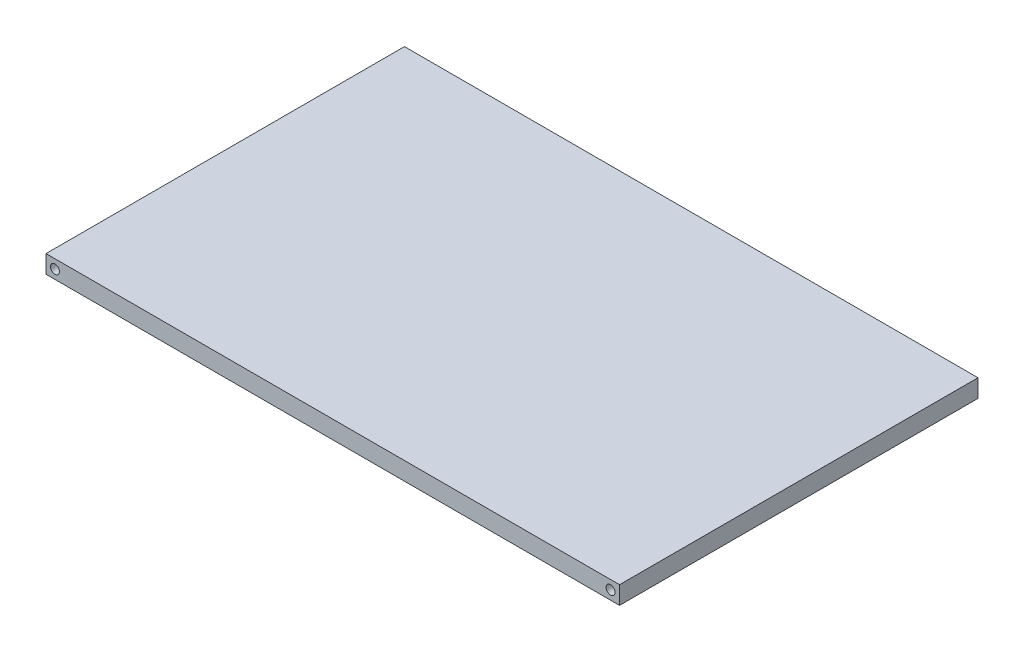
ISO-10303-21;
HEADER;
FILE_DESCRIPTION(('STEP AP214'),'2;1');
FILE_NAME('part.step','',(''),(''),'','','');
FILE_SCHEMA(('AUTOMOTIVE_DESIGN { 1 0 10303 214 1 1 1 1 }'));
ENDSEC;
DATA;
#1=APPLICATION_CONTEXT('core data for automotive mechanical design processes');
#2=APPLICATION_PROTOCOL_DEFINITION('international standard','automotive_design',2000,#1);
#3=PRODUCT_CONTEXT('',#1,'mechanical');
#4=PRODUCT('Part','Part','',(#3));
#5=PRODUCT_RELATED_PRODUCT_CATEGORY('part','',(#4));
#6=PRODUCT_DEFINITION_FORMATION('','',#4);
#7=PRODUCT_DEFINITION_CONTEXT('part definition',#1,'design');
#8=PRODUCT_DEFINITION('design','',#6,#7);
#9=PRODUCT_DEFINITION_SHAPE('','',#8);
#10=(LENGTH_UNIT() NAMED_UNIT(*) SI_UNIT(.MILLI.,.METRE.));
#11=(NAMED_UNIT(*) PLANE_ANGLE_UNIT() SI_UNIT($,.RADIAN.));
#12=(NAMED_UNIT(*) SI_UNIT($,.STERADIAN.) SOLID_ANGLE_UNIT());
#13=UNCERTAINTY_MEASURE_WITH_UNIT(LENGTH_MEASURE(1.E-05),#10,'distance_accuracy_value','');
#14=(GEOMETRIC_REPRESENTATION_CONTEXT(3) GLOBAL_UNCERTAINTY_ASSIGNED_CONTEXT((#13)) GLOBAL_UNIT_ASSIGNED_CONTEXT((#10,
#11,#12)) REPRESENTATION_CONTEXT('',''));
#15=CARTESIAN_POINT('',(0.,0.,0.));
#16=DIRECTION('',(0.,0.,1.));
#17=DIRECTION('',(1.,0.,0.));
#18=AXIS2_PLACEMENT_3D('',#15,#16,#17);
#19=CARTESIAN_POINT('',(-42.2044454578592,3.175,-20.6541242768741));
#20=DIRECTION('',(1.,0.,0.));
#21=DIRECTION('',(0.,0.,-1.));
#22=AXIS2_PLACEMENT_3D('',#19,#20,#21);
#23=PLANE('',#22);
#24=DIRECTION('',(0.,0.,1.));
#25=VECTOR('',#24,1.);
#26=CARTESIAN_POINT('',(-42.2044454578592,0.,-20.6541242768741));
#27=LINE('',#26,#25);
#28=CARTESIAN_POINT('',(-42.2044454578592,0.,-20.6541242768741));
#29=VERTEX_POINT('',#28);
#30=CARTESIAN_POINT('',(-42.2044454578592,0.,42.8458757231259));
#31=VERTEX_POINT('',#30);
#32=EDGE_CURVE('E95',#29,#31,#27,.T.);
#33=ORIENTED_EDGE('',*,*,#32,.T.);
#34=DIRECTION('',(0.,-1.,0.));
#35=VECTOR('',#34,1.);
#36=CARTESIAN_POINT('',(-42.2044454578592,3.175,42.8458757231259));
#37=LINE('',#36,#35);
#38=CARTESIAN_POINT('',(-42.2044454578592,3.175,42.8458757231259));
#39=VERTEX_POINT('',#38);
#40=EDGE_CURVE('E11',#39,#31,#37,.T.);
#41=ORIENTED_EDGE('',*,*,#40,.F.);
#42=DIRECTION('',(0.,0.,1.));
#43=VECTOR('',#42,1.);
#44=CARTESIAN_POINT('',(-42.2044454578592,3.175,-20.6541242768741));
#45=LINE('',#44,#43);
#46=CARTESIAN_POINT('',(-42.2044454578592,3.175,-20.6541242768741));
#47=VERTEX_POINT('',#46);
#48=EDGE_CURVE('E83',#47,#39,#45,.T.);
#49=ORIENTED_EDGE('',*,*,#48,.F.);
#50=DIRECTION('',(0.,-1.,0.));
#51=VECTOR('',#50,1.);
#52=CARTESIAN_POINT('',(-42.2044454578592,3.175,-20.6541242768741));
#53=LINE('',#52,#51);
#54=EDGE_CURVE('E91',#47,#29,#53,.T.);
#55=ORIENTED_EDGE('',*,*,#54,.T.);
#56=EDGE_LOOP('',(#33,#41,#49,#55));
#57=FACE_BOUND('',#56,.T.);
#58=ADVANCED_FACE('F32',(#57),#23,.F.);
#59=CARTESIAN_POINT('',(-42.2044454578592,3.175,42.8458757231259));
#60=DIRECTION('',(0.,0.,-1.));
#61=DIRECTION('',(-1.,0.,0.));
#62=AXIS2_PLACEMENT_3D('',#59,#60,#61);
#63=PLANE('',#62);
#64=CARTESIAN_POINT('',(57.8080545421408,1.5875,42.8458757231259));
#65=DIRECTION('',(0.,0.,1.));
#66=DIRECTION('',(1.,0.,0.));
#67=AXIS2_PLACEMENT_3D('',#64,#65,#66);
#68=CIRCLE('',#67,0.79375);
#69=CARTESIAN_POINT('',(58.6018045421408,1.5875,42.8458757231259));
#70=VERTEX_POINT('',#69);
#71=EDGE_CURVE('E115',#70,#70,#68,.T.);
#72=ORIENTED_EDGE('',*,*,#71,.F.);
#73=EDGE_LOOP('',(#72));
#74=FACE_BOUND('',#73,.T.);
#75=CARTESIAN_POINT('',(-40.6169454578592,1.5875,42.8458757231259));
#76=DIRECTION('',(0.,0.,1.));
#77=DIRECTION('',(1.,0.,0.));
#78=AXIS2_PLACEMENT_3D('',#75,#76,#77);
#79=CIRCLE('',#78,0.79375);
#80=CARTESIAN_POINT('',(-39.8231954578592,1.5875,42.8458757231259));
#81=VERTEX_POINT('',#80);
#82=EDGE_CURVE('E109',#81,#81,#79,.T.);
#83=ORIENTED_EDGE('',*,*,#82,.F.);
#84=EDGE_LOOP('',(#83));
#85=FACE_BOUND('',#84,.T.);
#86=DIRECTION('',(1.,0.,0.));
#87=VECTOR('',#86,1.);
#88=CARTESIAN_POINT('',(-42.2044454578592,0.,42.8458757231259));
#89=LINE('',#88,#87);
#90=CARTESIAN_POINT('',(59.3955545421408,0.,42.8458757231259));
#91=VERTEX_POINT('',#90);
#92=EDGE_CURVE('E87',#31,#91,#89,.T.);
#93=ORIENTED_EDGE('',*,*,#92,.T.);
#94=DIRECTION('',(0.,-1.,0.));
#95=VECTOR('',#94,1.);
#96=CARTESIAN_POINT('',(59.3955545421408,3.175,42.8458757231259));
#97=LINE('',#96,#95);
#98=CARTESIAN_POINT('',(59.3955545421408,3.175,42.8458757231259));
#99=VERTEX_POINT('',#98);
#100=EDGE_CURVE('E40',#99,#91,#97,.T.);
#101=ORIENTED_EDGE('',*,*,#100,.F.);
#102=DIRECTION('',(1.,0.,0.));
#103=VECTOR('',#102,1.);
#104=CARTESIAN_POINT('',(-42.2044454578592,3.175,42.8458757231259));
#105=LINE('',#104,#103);
#106=EDGE_CURVE('E78',#39,#99,#105,.T.);
#107=ORIENTED_EDGE('',*,*,#106,.F.);
#108=ORIENTED_EDGE('',*,*,#40,.T.);
#109=EDGE_LOOP('',(#93,#101,#107,#108));
#110=FACE_BOUND('',#109,.T.);
#111=ADVANCED_FACE('F86',(#74,#85,#110),#63,.F.);
#112=CARTESIAN_POINT('',(59.3955545421408,3.175,-20.6541242768741));
#113=DIRECTION('',(-1.,0.,0.));
#114=DIRECTION('',(0.,0.,1.));
#115=AXIS2_PLACEMENT_3D('',#112,#113,#114);
#116=PLANE('',#115);
#117=DIRECTION('',(0.,0.,-1.));
#118=VECTOR('',#117,1.);
#119=CARTESIAN_POINT('',(59.3955545421408,0.,-20.6541242768741));
#120=LINE('',#119,#118);
#121=CARTESIAN_POINT('',(59.3955545421408,0.,-20.6541242768741));
#122=VERTEX_POINT('',#121);
#123=EDGE_CURVE('E65',#91,#122,#120,.T.);
#124=ORIENTED_EDGE('',*,*,#123,.T.);
#125=DIRECTION('',(0.,-1.,0.));
#126=VECTOR('',#125,1.);
#127=CARTESIAN_POINT('',(59.3955545421408,3.175,-20.6541242768741));
#128=LINE('',#127,#126);
#129=CARTESIAN_POINT('',(59.3955545421408,3.175,-20.6541242768741));
#130=VERTEX_POINT('',#129);
#131=EDGE_CURVE('E88',#130,#122,#128,.T.);
#132=ORIENTED_EDGE('',*,*,#131,.F.);
#133=DIRECTION('',(0.,0.,-1.));
#134=VECTOR('',#133,1.);
#135=CARTESIAN_POINT('',(59.3955545421408,3.175,-20.6541242768741));
#136=LINE('',#135,#134);
#137=EDGE_CURVE('E81',#99,#130,#136,.T.);
#138=ORIENTED_EDGE('',*,*,#137,.F.);
#139=ORIENTED_EDGE('',*,*,#100,.T.);
#140=EDGE_LOOP('',(#124,#132,#138,#139));
#141=FACE_BOUND('',#140,.T.);
#142=ADVANCED_FACE('F89',(#141),#116,.F.);
#143=CARTESIAN_POINT('',(-42.2044454578592,3.175,-20.6541242768741));
#144=DIRECTION('',(0.,0.,1.));
#145=DIRECTION('',(1.,0.,0.));
#146=AXIS2_PLACEMENT_3D('',#143,#144,#145);
#147=PLANE('',#146);
#148=CARTESIAN_POINT('',(-40.6169454578592,1.5875,-20.6541242768741));
#149=DIRECTION('',(0.,0.,-1.));
#150=DIRECTION('',(-1.,0.,0.));
#151=AXIS2_PLACEMENT_3D('',#148,#149,#150);
#152=CIRCLE('',#151,0.79375);
#153=CARTESIAN_POINT('',(-41.4106954578592,1.5875,-20.6541242768741));
#154=VERTEX_POINT('',#153);
#155=EDGE_CURVE('E127',#154,#154,#152,.T.);
#156=ORIENTED_EDGE('',*,*,#155,.F.);
#157=EDGE_LOOP('',(#156));
#158=FACE_BOUND('',#157,.T.);
#159=CARTESIAN_POINT('',(57.8080545421408,1.5875,-20.6541242768741));
#160=DIRECTION('',(0.,0.,-1.));
#161=DIRECTION('',(-1.,0.,0.));
#162=AXIS2_PLACEMENT_3D('',#159,#160,#161);
#163=CIRCLE('',#162,0.79375);
#164=CARTESIAN_POINT('',(57.0143045421408,1.5875,-20.6541242768741));
#165=VERTEX_POINT('',#164);
#166=EDGE_CURVE('E121',#165,#165,#163,.T.);
#167=ORIENTED_EDGE('',*,*,#166,.F.);
#168=EDGE_LOOP('',(#167));
#169=FACE_BOUND('',#168,.T.);
#170=DIRECTION('',(-1.,0.,0.));
#171=VECTOR('',#170,1.);
#172=CARTESIAN_POINT('',(-42.2044454578592,0.,-20.6541242768741));
#173=LINE('',#172,#171);
#174=EDGE_CURVE('E71',#122,#29,#173,.T.);
#175=ORIENTED_EDGE('',*,*,#174,.T.);
#176=ORIENTED_EDGE('',*,*,#54,.F.);
#177=DIRECTION('',(-1.,0.,0.));
#178=VECTOR('',#177,1.);
#179=CARTESIAN_POINT('',(-42.2044454578592,3.175,-20.6541242768741));
#180=LINE('',#179,#178);
#181=EDGE_CURVE('E48',#130,#47,#180,.T.);
#182=ORIENTED_EDGE('',*,*,#181,.F.);
#183=ORIENTED_EDGE('',*,*,#131,.T.);
#184=EDGE_LOOP('',(#175,#176,#182,#183));
#185=FACE_BOUND('',#184,.T.);
#186=ADVANCED_FACE('F103',(#158,#169,#185),#147,.F.);
#187=CARTESIAN_POINT('',(0.,3.175,0.));
#188=DIRECTION('',(0.,1.,0.));
#189=DIRECTION('',(0.,0.,1.));
#190=AXIS2_PLACEMENT_3D('',#187,#188,#189);
#191=PLANE('',#190);
#192=ORIENTED_EDGE('',*,*,#48,.T.);
#193=ORIENTED_EDGE('',*,*,#106,.T.);
#194=ORIENTED_EDGE('',*,*,#137,.T.);
#195=ORIENTED_EDGE('',*,*,#181,.T.);
#196=EDGE_LOOP('',(#192,#193,#194,#195));
#197=FACE_BOUND('',#196,.T.);
#198=ADVANCED_FACE('F79',(#197),#191,.T.);
#199=CARTESIAN_POINT('',(0.,0.,0.));
#200=DIRECTION('',(0.,1.,0.));
#201=DIRECTION('',(0.,0.,1.));
#202=AXIS2_PLACEMENT_3D('',#199,#200,#201);
#203=PLANE('',#202);
#204=ORIENTED_EDGE('',*,*,#32,.F.);
#205=ORIENTED_EDGE('',*,*,#174,.F.);
#206=ORIENTED_EDGE('',*,*,#123,.F.);
#207=ORIENTED_EDGE('',*,*,#92,.F.);
#208=EDGE_LOOP('',(#204,#205,#206,#207));
#209=FACE_BOUND('',#208,.T.);
#210=ADVANCED_FACE('F106',(#209),#203,.F.);
#211=CARTESIAN_POINT('',(-40.6169454578592,1.5875,36.4958757231259));
#212=DIRECTION('',(0.,0.,1.));
#213=DIRECTION('',(1.,0.,0.));
#214=AXIS2_PLACEMENT_3D('',#211,#212,#213);
#215=CYLINDRICAL_SURFACE('',#214,0.79375);
#216=CARTESIAN_POINT('',(-40.6169454578592,1.5875,36.4958757231259));
#217=DIRECTION('',(0.,0.,1.));
#218=DIRECTION('',(1.,0.,0.));
#219=AXIS2_PLACEMENT_3D('',#216,#217,#218);
#220=CIRCLE('',#219,0.79375);
#221=CARTESIAN_POINT('',(-39.8231954578592,1.5875,36.4958757231259));
#222=VERTEX_POINT('',#221);
#223=EDGE_CURVE('E98',#222,#222,#220,.T.);
#224=ORIENTED_EDGE('',*,*,#223,.F.);
#225=EDGE_LOOP('',(#224));
#226=FACE_BOUND('',#225,.T.);
#227=ORIENTED_EDGE('',*,*,#82,.T.);
#228=EDGE_LOOP('',(#227));
#229=FACE_BOUND('',#228,.T.);
#230=ADVANCED_FACE('F176',(#226,#229),#215,.F.);
#231=CARTESIAN_POINT('',(-40.6169454578592,1.5875,36.4958757231259));
#232=DIRECTION('',(0.,0.,1.));
#233=DIRECTION('',(1.,0.,0.));
#234=AXIS2_PLACEMENT_3D('',#231,#232,#233);
#235=PLANE('',#234);
#236=ORIENTED_EDGE('',*,*,#223,.T.);
#237=EDGE_LOOP('',(#236));
#238=FACE_BOUND('',#237,.T.);
#239=ADVANCED_FACE('F181',(#238),#235,.T.);
#240=CARTESIAN_POINT('',(57.8080545421408,1.5875,36.4958757231259));
#241=DIRECTION('',(0.,0.,1.));
#242=DIRECTION('',(1.,0.,0.));
#243=AXIS2_PLACEMENT_3D('',#240,#241,#242);
#244=CYLINDRICAL_SURFACE('',#243,0.79375);
#245=CARTESIAN_POINT('',(57.8080545421408,1.5875,36.4958757231259));
#246=DIRECTION('',(0.,0.,1.));
#247=DIRECTION('',(1.,0.,0.));
#248=AXIS2_PLACEMENT_3D('',#245,#246,#247);
#249=CIRCLE('',#248,0.79375);
#250=CARTESIAN_POINT('',(58.6018045421408,1.5875,36.4958757231259));
#251=VERTEX_POINT('',#250);
#252=EDGE_CURVE('E112',#251,#251,#249,.T.);
#253=ORIENTED_EDGE('',*,*,#252,.F.);
#254=EDGE_LOOP('',(#253));
#255=FACE_BOUND('',#254,.T.);
#256=ORIENTED_EDGE('',*,*,#71,.T.);
#257=EDGE_LOOP('',(#256));
#258=FACE_BOUND('',#257,.T.);
#259=ADVANCED_FACE('F158',(#255,#258),#244,.F.);
#260=CARTESIAN_POINT('',(57.8080545421408,1.5875,36.4958757231259));
#261=DIRECTION('',(0.,0.,1.));
#262=DIRECTION('',(1.,0.,0.));
#263=AXIS2_PLACEMENT_3D('',#260,#261,#262);
#264=PLANE('',#263);
#265=ORIENTED_EDGE('',*,*,#252,.T.);
#266=EDGE_LOOP('',(#265));
#267=FACE_BOUND('',#266,.T.);
#268=ADVANCED_FACE('F149',(#267),#264,.T.);
#269=CARTESIAN_POINT('',(57.8080545421408,1.5875,-14.3041242768741));
#270=DIRECTION('',(0.,0.,-1.));
#271=DIRECTION('',(-1.,0.,0.));
#272=AXIS2_PLACEMENT_3D('',#269,#270,#271);
#273=CYLINDRICAL_SURFACE('',#272,0.79375);
#274=CARTESIAN_POINT('',(57.8080545421408,1.5875,-14.3041242768741));
#275=DIRECTION('',(0.,0.,-1.));
#276=DIRECTION('',(-1.,0.,0.));
#277=AXIS2_PLACEMENT_3D('',#274,#275,#276);
#278=CIRCLE('',#277,0.79375);
#279=CARTESIAN_POINT('',(57.0143045421408,1.5875,-14.3041242768741));
#280=VERTEX_POINT('',#279);
#281=EDGE_CURVE('E118',#280,#280,#278,.T.);
#282=ORIENTED_EDGE('',*,*,#281,.F.);
#283=EDGE_LOOP('',(#282));
#284=FACE_BOUND('',#283,.T.);
#285=ORIENTED_EDGE('',*,*,#166,.T.);
#286=EDGE_LOOP('',(#285));
#287=FACE_BOUND('',#286,.T.);
#288=ADVANCED_FACE('F147',(#284,#287),#273,.F.);
#289=CARTESIAN_POINT('',(57.8080545421408,1.5875,-14.3041242768741));
#290=DIRECTION('',(0.,0.,-1.));
#291=DIRECTION('',(-1.,0.,0.));
#292=AXIS2_PLACEMENT_3D('',#289,#290,#291);
#293=PLANE('',#292);
#294=ORIENTED_EDGE('',*,*,#281,.T.);
#295=EDGE_LOOP('',(#294));
#296=FACE_BOUND('',#295,.T.);
#297=ADVANCED_FACE('F138',(#296),#293,.T.);
#298=CARTESIAN_POINT('',(-40.6169454578592,1.5875,-14.3041242768741));
#299=DIRECTION('',(0.,0.,-1.));
#300=DIRECTION('',(-1.,0.,0.));
#301=AXIS2_PLACEMENT_3D('',#298,#299,#300);
#302=CYLINDRICAL_SURFACE('',#301,0.79375);
#303=CARTESIAN_POINT('',(-40.6169454578592,1.5875,-14.3041242768741));
#304=DIRECTION('',(0.,0.,-1.));
#305=DIRECTION('',(-1.,0.,0.));
#306=AXIS2_PLACEMENT_3D('',#303,#304,#305);
#307=CIRCLE('',#306,0.79375);
#308=CARTESIAN_POINT('',(-41.4106954578592,1.5875,-14.3041242768741));
#309=VERTEX_POINT('',#308);
#310=EDGE_CURVE('E124',#309,#309,#307,.T.);
#311=ORIENTED_EDGE('',*,*,#310,.F.);
#312=EDGE_LOOP('',(#311));
#313=FACE_BOUND('',#312,.T.);
#314=ORIENTED_EDGE('',*,*,#155,.T.);
#315=EDGE_LOOP('',(#314));
#316=FACE_BOUND('',#315,.T.);
#317=ADVANCED_FACE('F135',(#313,#316),#302,.F.);
#318=CARTESIAN_POINT('',(-40.6169454578592,1.5875,-14.3041242768741));
#319=DIRECTION('',(0.,0.,-1.));
#320=DIRECTION('',(-1.,0.,0.));
#321=AXIS2_PLACEMENT_3D('',#318,#319,#320);
#322=PLANE('',#321);
#323=ORIENTED_EDGE('',*,*,#310,.T.);
#324=EDGE_LOOP('',(#323));
#325=FACE_BOUND('',#324,.T.);
#326=ADVANCED_FACE('F133',(#325),#322,.T.);
#327=CLOSED_SHELL('',(#58,#111,#142,#186,#198,#210,#230,#239,#259,#268,#288,#297,#317,#326));
#328=MANIFOLD_SOLID_BREP('B2',#327);
#329=ADVANCED_BREP_SHAPE_REPRESENTATION('',(#18,#328),#14);
#330=SHAPE_DEFINITION_REPRESENTATION(#9,#329);
ENDSEC;
END-ISO-10303-21;
